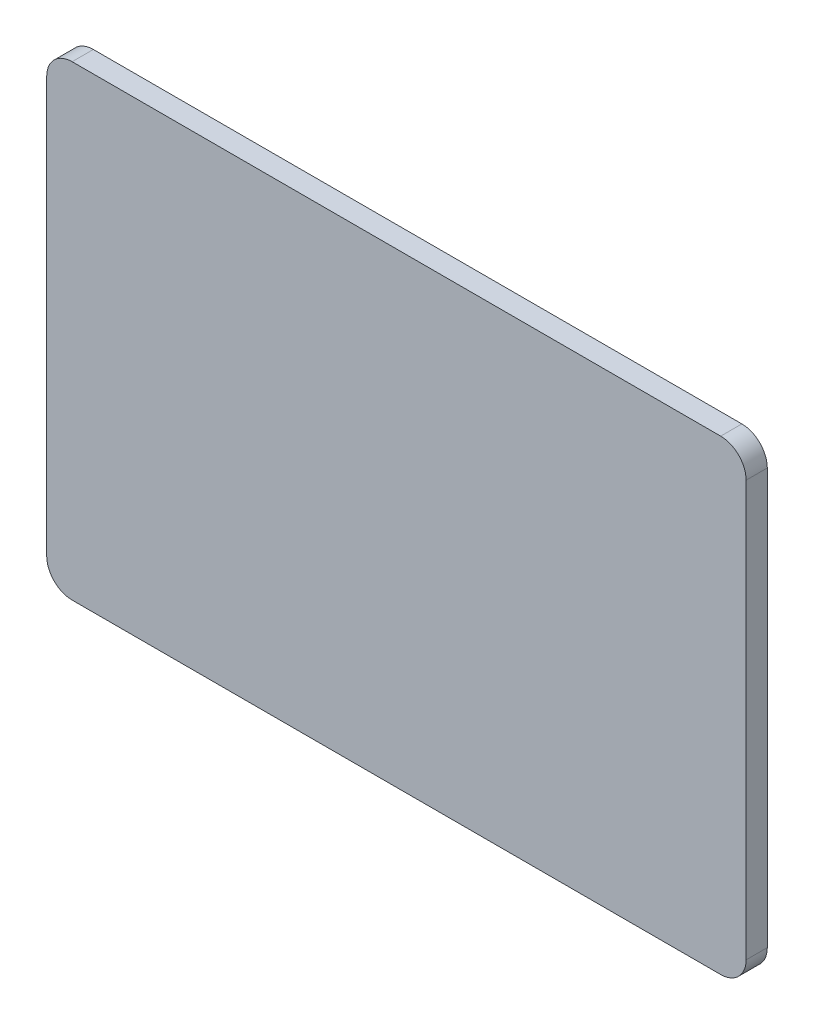
ISO-10303-21;
HEADER;
FILE_DESCRIPTION(('STEP AP214'),'2;1');
FILE_NAME('part.step','',(''),(''),'','','');
FILE_SCHEMA(('AUTOMOTIVE_DESIGN { 1 0 10303 214 1 1 1 1 }'));
ENDSEC;
DATA;
#1=APPLICATION_CONTEXT('core data for automotive mechanical design processes');
#2=APPLICATION_PROTOCOL_DEFINITION('international standard','automotive_design',2000,#1);
#3=PRODUCT_CONTEXT('',#1,'mechanical');
#4=PRODUCT('Part','Part','',(#3));
#5=PRODUCT_RELATED_PRODUCT_CATEGORY('part','',(#4));
#6=PRODUCT_DEFINITION_FORMATION('','',#4);
#7=PRODUCT_DEFINITION_CONTEXT('part definition',#1,'design');
#8=PRODUCT_DEFINITION('design','',#6,#7);
#9=PRODUCT_DEFINITION_SHAPE('','',#8);
#10=(LENGTH_UNIT() NAMED_UNIT(*) SI_UNIT(.MILLI.,.METRE.));
#11=(NAMED_UNIT(*) PLANE_ANGLE_UNIT() SI_UNIT($,.RADIAN.));
#12=(NAMED_UNIT(*) SI_UNIT($,.STERADIAN.) SOLID_ANGLE_UNIT());
#13=UNCERTAINTY_MEASURE_WITH_UNIT(LENGTH_MEASURE(1.E-05),#10,'distance_accuracy_value','');
#14=(GEOMETRIC_REPRESENTATION_CONTEXT(3) GLOBAL_UNCERTAINTY_ASSIGNED_CONTEXT((#13)) GLOBAL_UNIT_ASSIGNED_CONTEXT((#10,
#11,#12)) REPRESENTATION_CONTEXT('',''));
#15=CARTESIAN_POINT('',(0.,0.,0.));
#16=DIRECTION('',(0.,0.,1.));
#17=DIRECTION('',(1.,0.,0.));
#18=AXIS2_PLACEMENT_3D('',#15,#16,#17);
#19=CARTESIAN_POINT('',(795.,30.,25.));
#20=DIRECTION('',(0.,0.,-1.));
#21=DIRECTION('',(-1.,0.,0.));
#22=AXIS2_PLACEMENT_3D('',#19,#20,#21);
#23=CYLINDRICAL_SURFACE('',#22,30.);
#24=DIRECTION('',(0.,0.,-1.));
#25=VECTOR('',#24,1.);
#26=CARTESIAN_POINT('',(825.,30.,25.));
#27=LINE('',#26,#25);
#28=CARTESIAN_POINT('',(825.,30.,25.));
#29=VERTEX_POINT('',#28);
#30=CARTESIAN_POINT('',(825.,30.,0.));
#31=VERTEX_POINT('',#30);
#32=EDGE_CURVE('E171',#29,#31,#27,.T.);
#33=ORIENTED_EDGE('',*,*,#32,.F.);
#34=CARTESIAN_POINT('',(795.,30.,25.));
#35=DIRECTION('',(0.,0.,-1.));
#36=DIRECTION('',(-1.,0.,0.));
#37=AXIS2_PLACEMENT_3D('',#34,#35,#36);
#38=CIRCLE('',#37,30.);
#39=CARTESIAN_POINT('',(795.,0.,25.));
#40=VERTEX_POINT('',#39);
#41=EDGE_CURVE('E50',#40,#29,#38,.F.);
#42=ORIENTED_EDGE('',*,*,#41,.F.);
#43=DIRECTION('',(0.,0.,-1.));
#44=VECTOR('',#43,1.);
#45=CARTESIAN_POINT('',(795.,0.,25.));
#46=LINE('',#45,#44);
#47=CARTESIAN_POINT('',(795.,0.,0.));
#48=VERTEX_POINT('',#47);
#49=EDGE_CURVE('E175',#48,#40,#46,.F.);
#50=ORIENTED_EDGE('',*,*,#49,.F.);
#51=CARTESIAN_POINT('',(795.,30.,0.));
#52=DIRECTION('',(0.,0.,-1.));
#53=DIRECTION('',(-1.,0.,0.));
#54=AXIS2_PLACEMENT_3D('',#51,#52,#53);
#55=CIRCLE('',#54,30.);
#56=EDGE_CURVE('E11',#31,#48,#55,.T.);
#57=ORIENTED_EDGE('',*,*,#56,.F.);
#58=EDGE_LOOP('',(#33,#42,#50,#57));
#59=FACE_BOUND('',#58,.T.);
#60=ADVANCED_FACE('F42',(#59),#23,.T.);
#61=CARTESIAN_POINT('',(30.,30.,25.));
#62=DIRECTION('',(0.,0.,1.));
#63=DIRECTION('',(1.,0.,0.));
#64=AXIS2_PLACEMENT_3D('',#61,#62,#63);
#65=CYLINDRICAL_SURFACE('',#64,30.);
#66=DIRECTION('',(0.,0.,1.));
#67=VECTOR('',#66,1.);
#68=CARTESIAN_POINT('',(0.,30.,25.));
#69=LINE('',#68,#67);
#70=CARTESIAN_POINT('',(0.,30.,0.));
#71=VERTEX_POINT('',#70);
#72=CARTESIAN_POINT('',(0.,30.,25.));
#73=VERTEX_POINT('',#72);
#74=EDGE_CURVE('E157',#71,#73,#69,.T.);
#75=ORIENTED_EDGE('',*,*,#74,.F.);
#76=CARTESIAN_POINT('',(30.,30.,0.));
#77=DIRECTION('',(0.,0.,-1.));
#78=DIRECTION('',(-1.,0.,0.));
#79=AXIS2_PLACEMENT_3D('',#76,#77,#78);
#80=CIRCLE('',#79,30.);
#81=CARTESIAN_POINT('',(30.,0.,0.));
#82=VERTEX_POINT('',#81);
#83=EDGE_CURVE('E165',#82,#71,#80,.T.);
#84=ORIENTED_EDGE('',*,*,#83,.F.);
#85=DIRECTION('',(0.,0.,1.));
#86=VECTOR('',#85,1.);
#87=CARTESIAN_POINT('',(30.,0.,25.));
#88=LINE('',#87,#86);
#89=CARTESIAN_POINT('',(30.,0.,25.));
#90=VERTEX_POINT('',#89);
#91=EDGE_CURVE('E161',#90,#82,#88,.F.);
#92=ORIENTED_EDGE('',*,*,#91,.F.);
#93=CARTESIAN_POINT('',(30.,30.,25.));
#94=DIRECTION('',(0.,0.,-1.));
#95=DIRECTION('',(-1.,0.,0.));
#96=AXIS2_PLACEMENT_3D('',#93,#94,#95);
#97=CIRCLE('',#96,30.);
#98=EDGE_CURVE('E168',#73,#90,#97,.F.);
#99=ORIENTED_EDGE('',*,*,#98,.F.);
#100=EDGE_LOOP('',(#75,#84,#92,#99));
#101=FACE_BOUND('',#100,.T.);
#102=ADVANCED_FACE('F209',(#101),#65,.T.);
#103=CARTESIAN_POINT('',(795.,520.,25.));
#104=DIRECTION('',(0.,0.,-1.));
#105=DIRECTION('',(-1.,0.,0.));
#106=AXIS2_PLACEMENT_3D('',#103,#104,#105);
#107=CYLINDRICAL_SURFACE('',#106,30.);
#108=DIRECTION('',(0.,0.,-1.));
#109=VECTOR('',#108,1.);
#110=CARTESIAN_POINT('',(795.,550.,25.));
#111=LINE('',#110,#109);
#112=CARTESIAN_POINT('',(795.,550.,25.));
#113=VERTEX_POINT('',#112);
#114=CARTESIAN_POINT('',(795.,550.,0.));
#115=VERTEX_POINT('',#114);
#116=EDGE_CURVE('E113',#113,#115,#111,.T.);
#117=ORIENTED_EDGE('',*,*,#116,.F.);
#118=CARTESIAN_POINT('',(795.,520.,25.));
#119=DIRECTION('',(0.,0.,-1.));
#120=DIRECTION('',(-1.,0.,0.));
#121=AXIS2_PLACEMENT_3D('',#118,#119,#120);
#122=CIRCLE('',#121,30.);
#123=CARTESIAN_POINT('',(825.,520.,25.));
#124=VERTEX_POINT('',#123);
#125=EDGE_CURVE('E151',#124,#113,#122,.F.);
#126=ORIENTED_EDGE('',*,*,#125,.F.);
#127=DIRECTION('',(0.,0.,-1.));
#128=VECTOR('',#127,1.);
#129=CARTESIAN_POINT('',(825.,520.,25.));
#130=LINE('',#129,#128);
#131=CARTESIAN_POINT('',(825.,520.,0.));
#132=VERTEX_POINT('',#131);
#133=EDGE_CURVE('E147',#132,#124,#130,.F.);
#134=ORIENTED_EDGE('',*,*,#133,.F.);
#135=CARTESIAN_POINT('',(795.,520.,0.));
#136=DIRECTION('',(0.,0.,-1.));
#137=DIRECTION('',(-1.,0.,0.));
#138=AXIS2_PLACEMENT_3D('',#135,#136,#137);
#139=CIRCLE('',#138,30.);
#140=EDGE_CURVE('E154',#115,#132,#139,.T.);
#141=ORIENTED_EDGE('',*,*,#140,.F.);
#142=EDGE_LOOP('',(#117,#126,#134,#141));
#143=FACE_BOUND('',#142,.T.);
#144=ADVANCED_FACE('F201',(#143),#107,.T.);
#145=CARTESIAN_POINT('',(30.,520.,25.));
#146=DIRECTION('',(0.,0.,1.));
#147=DIRECTION('',(1.,0.,0.));
#148=AXIS2_PLACEMENT_3D('',#145,#146,#147);
#149=CYLINDRICAL_SURFACE('',#148,30.);
#150=DIRECTION('',(0.,0.,1.));
#151=VECTOR('',#150,1.);
#152=CARTESIAN_POINT('',(30.,550.,25.));
#153=LINE('',#152,#151);
#154=CARTESIAN_POINT('',(30.,550.,0.));
#155=VERTEX_POINT('',#154);
#156=CARTESIAN_POINT('',(30.,550.,25.));
#157=VERTEX_POINT('',#156);
#158=EDGE_CURVE('E111',#155,#157,#153,.T.);
#159=ORIENTED_EDGE('',*,*,#158,.F.);
#160=CARTESIAN_POINT('',(30.,520.,0.));
#161=DIRECTION('',(0.,0.,-1.));
#162=DIRECTION('',(-1.,0.,0.));
#163=AXIS2_PLACEMENT_3D('',#160,#161,#162);
#164=CIRCLE('',#163,30.);
#165=CARTESIAN_POINT('',(0.,520.,0.));
#166=VERTEX_POINT('',#165);
#167=EDGE_CURVE('E120',#166,#155,#164,.T.);
#168=ORIENTED_EDGE('',*,*,#167,.F.);
#169=DIRECTION('',(0.,0.,1.));
#170=VECTOR('',#169,1.);
#171=CARTESIAN_POINT('',(0.,520.,25.));
#172=LINE('',#171,#170);
#173=CARTESIAN_POINT('',(0.,520.,25.));
#174=VERTEX_POINT('',#173);
#175=EDGE_CURVE('E129',#174,#166,#172,.F.);
#176=ORIENTED_EDGE('',*,*,#175,.F.);
#177=CARTESIAN_POINT('',(30.,520.,25.));
#178=DIRECTION('',(0.,0.,-1.));
#179=DIRECTION('',(-1.,0.,0.));
#180=AXIS2_PLACEMENT_3D('',#177,#178,#179);
#181=CIRCLE('',#180,30.);
#182=EDGE_CURVE('E128',#157,#174,#181,.F.);
#183=ORIENTED_EDGE('',*,*,#182,.F.);
#184=EDGE_LOOP('',(#159,#168,#176,#183));
#185=FACE_BOUND('',#184,.T.);
#186=ADVANCED_FACE('F132',(#185),#149,.T.);
#187=CARTESIAN_POINT('',(0.,0.,25.));
#188=DIRECTION('',(1.,0.,0.));
#189=DIRECTION('',(0.,0.,-1.));
#190=AXIS2_PLACEMENT_3D('',#187,#188,#189);
#191=PLANE('',#190);
#192=DIRECTION('',(0.,-1.,0.));
#193=VECTOR('',#192,1.);
#194=CARTESIAN_POINT('',(0.,0.,0.));
#195=LINE('',#194,#193);
#196=EDGE_CURVE('E123',#166,#71,#195,.T.);
#197=ORIENTED_EDGE('',*,*,#196,.T.);
#198=ORIENTED_EDGE('',*,*,#74,.T.);
#199=DIRECTION('',(0.,-1.,0.));
#200=VECTOR('',#199,1.);
#201=CARTESIAN_POINT('',(0.,0.,25.));
#202=LINE('',#201,#200);
#203=EDGE_CURVE('E116',#174,#73,#202,.T.);
#204=ORIENTED_EDGE('',*,*,#203,.F.);
#205=ORIENTED_EDGE('',*,*,#175,.T.);
#206=EDGE_LOOP('',(#197,#198,#204,#205));
#207=FACE_BOUND('',#206,.T.);
#208=ADVANCED_FACE('F205',(#207),#191,.F.);
#209=CARTESIAN_POINT('',(0.,0.,25.));
#210=DIRECTION('',(0.,1.,0.));
#211=DIRECTION('',(0.,0.,1.));
#212=AXIS2_PLACEMENT_3D('',#209,#210,#211);
#213=PLANE('',#212);
#214=DIRECTION('',(1.,0.,0.));
#215=VECTOR('',#214,1.);
#216=CARTESIAN_POINT('',(0.,0.,0.));
#217=LINE('',#216,#215);
#218=EDGE_CURVE('E196',#82,#48,#217,.T.);
#219=ORIENTED_EDGE('',*,*,#218,.T.);
#220=ORIENTED_EDGE('',*,*,#49,.T.);
#221=DIRECTION('',(1.,0.,0.));
#222=VECTOR('',#221,1.);
#223=CARTESIAN_POINT('',(0.,0.,25.));
#224=LINE('',#223,#222);
#225=EDGE_CURVE('E184',#90,#40,#224,.T.);
#226=ORIENTED_EDGE('',*,*,#225,.F.);
#227=ORIENTED_EDGE('',*,*,#91,.T.);
#228=EDGE_LOOP('',(#219,#220,#226,#227));
#229=FACE_BOUND('',#228,.T.);
#230=ADVANCED_FACE('F212',(#229),#213,.F.);
#231=CARTESIAN_POINT('',(825.,0.,25.));
#232=DIRECTION('',(-1.,0.,0.));
#233=DIRECTION('',(0.,0.,1.));
#234=AXIS2_PLACEMENT_3D('',#231,#232,#233);
#235=PLANE('',#234);
#236=DIRECTION('',(0.,1.,0.));
#237=VECTOR('',#236,1.);
#238=CARTESIAN_POINT('',(825.,0.,25.));
#239=LINE('',#238,#237);
#240=EDGE_CURVE('E139',#29,#124,#239,.T.);
#241=ORIENTED_EDGE('',*,*,#240,.F.);
#242=ORIENTED_EDGE('',*,*,#32,.T.);
#243=DIRECTION('',(0.,1.,0.));
#244=VECTOR('',#243,1.);
#245=CARTESIAN_POINT('',(825.,0.,0.));
#246=LINE('',#245,#244);
#247=EDGE_CURVE('E117',#31,#132,#246,.T.);
#248=ORIENTED_EDGE('',*,*,#247,.T.);
#249=ORIENTED_EDGE('',*,*,#133,.T.);
#250=EDGE_LOOP('',(#241,#242,#248,#249));
#251=FACE_BOUND('',#250,.T.);
#252=ADVANCED_FACE('F186',(#251),#235,.F.);
#253=CARTESIAN_POINT('',(0.,550.,25.));
#254=DIRECTION('',(0.,-1.,0.));
#255=DIRECTION('',(0.,0.,-1.));
#256=AXIS2_PLACEMENT_3D('',#253,#254,#255);
#257=PLANE('',#256);
#258=DIRECTION('',(-1.,0.,0.));
#259=VECTOR('',#258,1.);
#260=CARTESIAN_POINT('',(0.,550.,25.));
#261=LINE('',#260,#259);
#262=EDGE_CURVE('E134',#113,#157,#261,.T.);
#263=ORIENTED_EDGE('',*,*,#262,.F.);
#264=ORIENTED_EDGE('',*,*,#116,.T.);
#265=DIRECTION('',(-1.,0.,0.));
#266=VECTOR('',#265,1.);
#267=CARTESIAN_POINT('',(0.,550.,0.));
#268=LINE('',#267,#266);
#269=EDGE_CURVE('E106',#115,#155,#268,.T.);
#270=ORIENTED_EDGE('',*,*,#269,.T.);
#271=ORIENTED_EDGE('',*,*,#158,.T.);
#272=EDGE_LOOP('',(#263,#264,#270,#271));
#273=FACE_BOUND('',#272,.T.);
#274=ADVANCED_FACE('F109',(#273),#257,.F.);
#275=CARTESIAN_POINT('',(0.,0.,25.));
#276=DIRECTION('',(0.,0.,-1.));
#277=DIRECTION('',(-1.,0.,0.));
#278=AXIS2_PLACEMENT_3D('',#275,#276,#277);
#279=PLANE('',#278);
#280=ORIENTED_EDGE('',*,*,#225,.T.);
#281=ORIENTED_EDGE('',*,*,#41,.T.);
#282=ORIENTED_EDGE('',*,*,#240,.T.);
#283=ORIENTED_EDGE('',*,*,#125,.T.);
#284=ORIENTED_EDGE('',*,*,#262,.T.);
#285=ORIENTED_EDGE('',*,*,#182,.T.);
#286=ORIENTED_EDGE('',*,*,#203,.T.);
#287=ORIENTED_EDGE('',*,*,#98,.T.);
#288=EDGE_LOOP('',(#280,#281,#282,#283,#284,#285,#286,#287));
#289=FACE_BOUND('',#288,.T.);
#290=ADVANCED_FACE('F180',(#289),#279,.F.);
#291=CARTESIAN_POINT('',(0.,0.,0.));
#292=DIRECTION('',(0.,0.,-1.));
#293=DIRECTION('',(-1.,0.,0.));
#294=AXIS2_PLACEMENT_3D('',#291,#292,#293);
#295=PLANE('',#294);
#296=ORIENTED_EDGE('',*,*,#247,.F.);
#297=ORIENTED_EDGE('',*,*,#56,.T.);
#298=ORIENTED_EDGE('',*,*,#218,.F.);
#299=ORIENTED_EDGE('',*,*,#83,.T.);
#300=ORIENTED_EDGE('',*,*,#196,.F.);
#301=ORIENTED_EDGE('',*,*,#167,.T.);
#302=ORIENTED_EDGE('',*,*,#269,.F.);
#303=ORIENTED_EDGE('',*,*,#140,.T.);
#304=EDGE_LOOP('',(#296,#297,#298,#299,#300,#301,#302,#303));
#305=FACE_BOUND('',#304,.T.);
#306=ADVANCED_FACE('F121',(#305),#295,.T.);
#307=CLOSED_SHELL('',(#60,#102,#144,#186,#208,#230,#252,#274,#290,#306));
#308=MANIFOLD_SOLID_BREP('B2',#307);
#309=ADVANCED_BREP_SHAPE_REPRESENTATION('',(#18,#308),#14);
#310=SHAPE_DEFINITION_REPRESENTATION(#9,#309);
ENDSEC;
END-ISO-10303-21;
